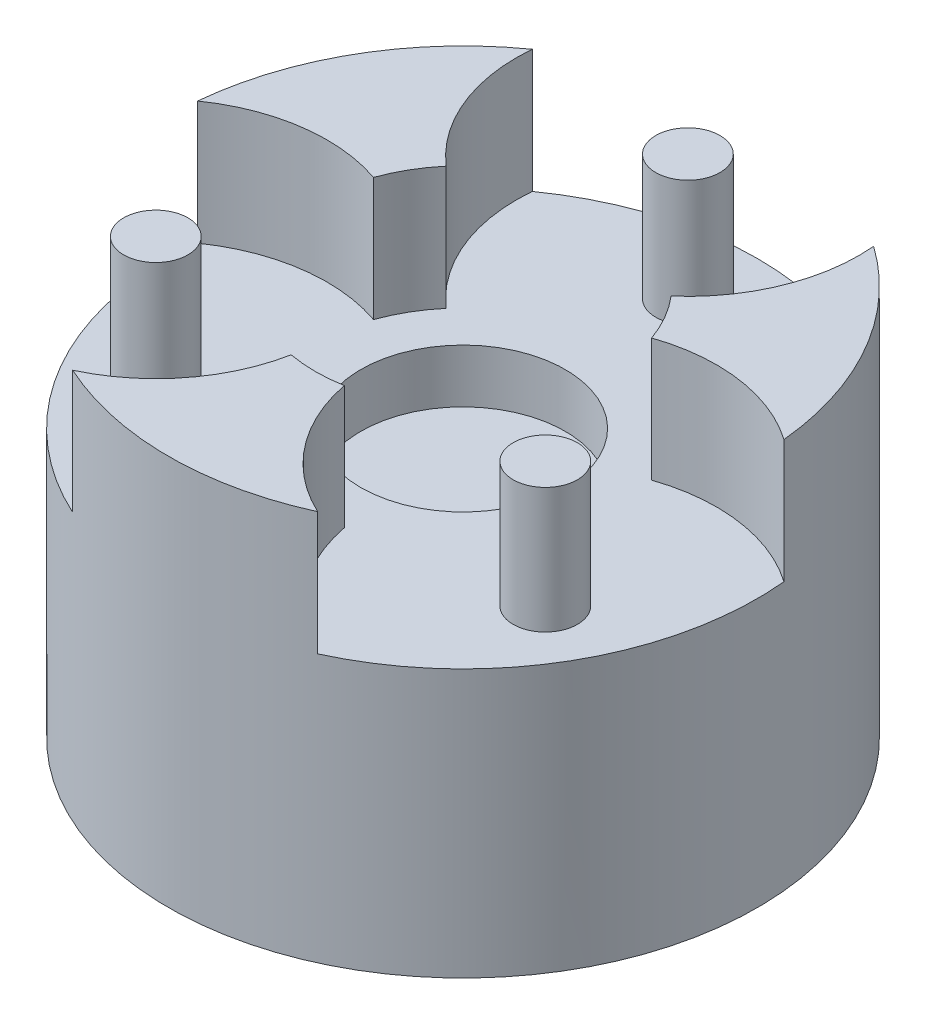
ISO-10303-21;
HEADER;
FILE_DESCRIPTION(('STEP AP214'),'2;1');
FILE_NAME('part.step','',(''),(''),'','','');
FILE_SCHEMA(('AUTOMOTIVE_DESIGN { 1 0 10303 214 1 1 1 1 }'));
ENDSEC;
DATA;
#1=APPLICATION_CONTEXT('core data for automotive mechanical design processes');
#2=APPLICATION_PROTOCOL_DEFINITION('international standard','automotive_design',2000,#1);
#3=PRODUCT_CONTEXT('',#1,'mechanical');
#4=PRODUCT('Part','Part','',(#3));
#5=PRODUCT_RELATED_PRODUCT_CATEGORY('part','',(#4));
#6=PRODUCT_DEFINITION_FORMATION('','',#4);
#7=PRODUCT_DEFINITION_CONTEXT('part definition',#1,'design');
#8=PRODUCT_DEFINITION('design','',#6,#7);
#9=PRODUCT_DEFINITION_SHAPE('','',#8);
#10=(LENGTH_UNIT() NAMED_UNIT(*) SI_UNIT(.MILLI.,.METRE.));
#11=(NAMED_UNIT(*) PLANE_ANGLE_UNIT() SI_UNIT($,.RADIAN.));
#12=(NAMED_UNIT(*) SI_UNIT($,.STERADIAN.) SOLID_ANGLE_UNIT());
#13=UNCERTAINTY_MEASURE_WITH_UNIT(LENGTH_MEASURE(1.E-05),#10,'distance_accuracy_value','');
#14=(GEOMETRIC_REPRESENTATION_CONTEXT(3) GLOBAL_UNCERTAINTY_ASSIGNED_CONTEXT((#13)) GLOBAL_UNIT_ASSIGNED_CONTEXT((#10,
#11,#12)) REPRESENTATION_CONTEXT('',''));
#15=CARTESIAN_POINT('',(0.,0.,0.));
#16=DIRECTION('',(0.,0.,1.));
#17=DIRECTION('',(1.,0.,0.));
#18=AXIS2_PLACEMENT_3D('',#15,#16,#17);
#19=CARTESIAN_POINT('',(0.,5.,0.));
#20=DIRECTION('',(0.,1.,0.));
#21=DIRECTION('',(0.,0.,1.));
#22=AXIS2_PLACEMENT_3D('',#19,#20,#21);
#23=PLANE('',#22);
#24=CARTESIAN_POINT('',(-18.1865334794733,5.,10.4999999999998));
#25=DIRECTION('',(0.,1.,0.));
#26=DIRECTION('',(0.,0.,1.));
#27=AXIS2_PLACEMENT_3D('',#24,#25,#26);
#28=CIRCLE('',#27,3.);
#29=CARTESIAN_POINT('',(-18.1865334794733,5.,13.4999999999998));
#30=VERTEX_POINT('',#29);
#31=EDGE_CURVE('E226',#30,#30,#28,.T.);
#32=ORIENTED_EDGE('',*,*,#31,.F.);
#33=EDGE_LOOP('',(#32));
#34=FACE_BOUND('',#33,.T.);
#35=CARTESIAN_POINT('',(18.1865334794732,5.,10.5000000000001));
#36=DIRECTION('',(0.,1.,0.));
#37=DIRECTION('',(0.,0.,1.));
#38=AXIS2_PLACEMENT_3D('',#35,#36,#37);
#39=CIRCLE('',#38,3.);
#40=CARTESIAN_POINT('',(18.1865334794732,5.,13.5000000000001));
#41=VERTEX_POINT('',#40);
#42=EDGE_CURVE('E232',#41,#41,#39,.T.);
#43=ORIENTED_EDGE('',*,*,#42,.F.);
#44=EDGE_LOOP('',(#43));
#45=FACE_BOUND('',#44,.T.);
#46=CARTESIAN_POINT('',(0.,5.,-21.));
#47=DIRECTION('',(0.,1.,0.));
#48=DIRECTION('',(0.,0.,1.));
#49=AXIS2_PLACEMENT_3D('',#46,#47,#48);
#50=CIRCLE('',#49,3.);
#51=CARTESIAN_POINT('',(0.,5.,-18.));
#52=VERTEX_POINT('',#51);
#53=EDGE_CURVE('E235',#52,#52,#50,.T.);
#54=ORIENTED_EDGE('',*,*,#53,.F.);
#55=EDGE_LOOP('',(#54));
#56=FACE_BOUND('',#55,.T.);
#57=CARTESIAN_POINT('',(0.,5.,0.));
#58=DIRECTION('',(0.,1.,0.));
#59=DIRECTION('',(0.,0.,1.));
#60=AXIS2_PLACEMENT_3D('',#57,#58,#59);
#61=CIRCLE('',#60,9.55);
#62=CARTESIAN_POINT('',(0.,5.,9.55));
#63=VERTEX_POINT('',#62);
#64=EDGE_CURVE('E137',#63,#63,#61,.T.);
#65=ORIENTED_EDGE('',*,*,#64,.F.);
#66=EDGE_LOOP('',(#65));
#67=FACE_BOUND('',#66,.T.);
#68=CARTESIAN_POINT('',(0.,5.,0.));
#69=DIRECTION('',(0.,-1.,0.));
#70=DIRECTION('',(0.,0.,1.));
#71=AXIS2_PLACEMENT_3D('',#68,#69,#70);
#72=CIRCLE('',#71,13.7883262115942);
#73=CARTESIAN_POINT('',(2.48245922660059,5.,13.5630135259684));
#74=VERTEX_POINT('',#73);
#75=CARTESIAN_POINT('',(-2.48245922660077,5.,13.5630135259683));
#76=VERTEX_POINT('',#75);
#77=EDGE_CURVE('E57',#74,#76,#72,.T.);
#78=ORIENTED_EDGE('',*,*,#77,.F.);
#79=CARTESIAN_POINT('',(18.1865334794732,5.,10.5000000000001));
#80=DIRECTION('',(0.,-1.,0.));
#81=DIRECTION('',(0.,0.,1.));
#82=AXIS2_PLACEMENT_3D('',#79,#80,#81);
#83=CIRCLE('',#82,16.);
#84=CARTESIAN_POINT('',(11.4394041014202,5.,25.0077994594569));
#85=VERTEX_POINT('',#84);
#86=EDGE_CURVE('E138',#85,#74,#83,.T.);
#87=ORIENTED_EDGE('',*,*,#86,.F.);
#88=CARTESIAN_POINT('',(0.,5.,0.));
#89=DIRECTION('',(0.,1.,0.));
#90=DIRECTION('',(0.,0.,1.));
#91=AXIS2_PLACEMENT_3D('',#88,#89,#90);
#92=CIRCLE('',#91,27.5);
#93=CARTESIAN_POINT('',(27.3770916753465,5.,-2.59708517374239));
#94=VERTEX_POINT('',#93);
#95=EDGE_CURVE('E50',#85,#94,#92,.T.);
#96=ORIENTED_EDGE('',*,*,#95,.T.);
#97=CARTESIAN_POINT('',(18.1865334794732,5.,10.5000000000001));
#98=DIRECTION('',(0.,-1.,0.));
#99=DIRECTION('',(0.,0.,1.));
#100=AXIS2_PLACEMENT_3D('',#97,#98,#99);
#101=CIRCLE('',#100,16.);
#102=CARTESIAN_POINT('',(12.9871438786609,5.,-4.63163400888887));
#103=VERTEX_POINT('',#102);
#104=EDGE_CURVE('E212',#103,#94,#101,.T.);
#105=ORIENTED_EDGE('',*,*,#104,.F.);
#106=CARTESIAN_POINT('',(0.,5.,0.));
#107=DIRECTION('',(0.,-1.,0.));
#108=DIRECTION('',(0.,0.,1.));
#109=AXIS2_PLACEMENT_3D('',#106,#107,#108);
#110=CIRCLE('',#109,13.7883262115942);
#111=CARTESIAN_POINT('',(10.5046846520602,5.,-8.9313795170794));
#112=VERTEX_POINT('',#111);
#113=EDGE_CURVE('E191',#112,#103,#110,.T.);
#114=ORIENTED_EDGE('',*,*,#113,.F.);
#115=CARTESIAN_POINT('',(0.,5.,-21.));
#116=DIRECTION('',(0.,-1.,0.));
#117=DIRECTION('',(0.,0.,1.));
#118=AXIS2_PLACEMENT_3D('',#115,#116,#117);
#119=CIRCLE('',#118,16.);
#120=CARTESIAN_POINT('',(15.9376875739262,5.,-22.4107142857143));
#121=VERTEX_POINT('',#120);
#122=EDGE_CURVE('E203',#121,#112,#119,.T.);
#123=ORIENTED_EDGE('',*,*,#122,.F.);
#124=CARTESIAN_POINT('',(-15.9376875739262,5.,-22.4107142857143));
#125=VERTEX_POINT('',#124);
#126=EDGE_CURVE('E11',#121,#125,#92,.T.);
#127=ORIENTED_EDGE('',*,*,#126,.T.);
#128=CARTESIAN_POINT('',(0.,5.,-21.));
#129=DIRECTION('',(0.,-1.,0.));
#130=DIRECTION('',(0.,0.,1.));
#131=AXIS2_PLACEMENT_3D('',#128,#129,#130);
#132=CIRCLE('',#131,16.);
#133=CARTESIAN_POINT('',(-10.5046846520602,5.,-8.9313795170794));
#134=VERTEX_POINT('',#133);
#135=EDGE_CURVE('E181',#134,#125,#132,.T.);
#136=ORIENTED_EDGE('',*,*,#135,.F.);
#137=CARTESIAN_POINT('',(0.,5.,0.));
#138=DIRECTION('',(0.,-1.,0.));
#139=DIRECTION('',(0.,0.,1.));
#140=AXIS2_PLACEMENT_3D('',#137,#138,#139);
#141=CIRCLE('',#140,13.7883262115942);
#142=CARTESIAN_POINT('',(-12.9871438786608,5.,-4.63163400888906));
#143=VERTEX_POINT('',#142);
#144=EDGE_CURVE('E184',#143,#134,#141,.T.);
#145=ORIENTED_EDGE('',*,*,#144,.F.);
#146=CARTESIAN_POINT('',(-18.1865334794733,5.,10.4999999999998));
#147=DIRECTION('',(0.,-1.,0.));
#148=DIRECTION('',(0.,0.,1.));
#149=AXIS2_PLACEMENT_3D('',#146,#147,#148);
#150=CIRCLE('',#149,16.);
#151=CARTESIAN_POINT('',(-27.3770916753465,5.,-2.59708517374277));
#152=VERTEX_POINT('',#151);
#153=EDGE_CURVE('E188',#152,#143,#150,.T.);
#154=ORIENTED_EDGE('',*,*,#153,.F.);
#155=CARTESIAN_POINT('',(-11.4394041014205,5.,25.0077994594567));
#156=VERTEX_POINT('',#155);
#157=EDGE_CURVE('E49',#152,#156,#92,.T.);
#158=ORIENTED_EDGE('',*,*,#157,.T.);
#159=CARTESIAN_POINT('',(-18.1865334794733,5.,10.4999999999998));
#160=DIRECTION('',(0.,-1.,0.));
#161=DIRECTION('',(0.,0.,1.));
#162=AXIS2_PLACEMENT_3D('',#159,#160,#161);
#163=CIRCLE('',#162,16.);
#164=EDGE_CURVE('E62',#76,#156,#163,.T.);
#165=ORIENTED_EDGE('',*,*,#164,.F.);
#166=EDGE_LOOP('',(#78,#87,#96,#105,#114,#123,#127,#136,#145,#154,#158,#165));
#167=FACE_BOUND('',#166,.T.);
#168=ADVANCED_FACE('F41',(#34,#45,#56,#67,#167),#23,.T.);
#169=CARTESIAN_POINT('',(0.,5.,0.));
#170=DIRECTION('',(0.,-1.,0.));
#171=DIRECTION('',(0.,0.,-1.));
#172=AXIS2_PLACEMENT_3D('',#169,#170,#171);
#173=CYLINDRICAL_SURFACE('',#172,27.5);
#174=ORIENTED_EDGE('',*,*,#126,.F.);
#175=DIRECTION('',(0.,-1.,0.));
#176=VECTOR('',#175,1.);
#177=CARTESIAN_POINT('',(15.9376875739262,16.5,-22.4107142857143));
#178=LINE('',#177,#176);
#179=CARTESIAN_POINT('',(15.9376875739262,16.5,-22.4107142857143));
#180=VERTEX_POINT('',#179);
#181=EDGE_CURVE('E218',#180,#121,#178,.T.);
#182=ORIENTED_EDGE('',*,*,#181,.F.);
#183=CARTESIAN_POINT('',(0.,16.5,0.));
#184=DIRECTION('',(0.,1.,0.));
#185=DIRECTION('',(0.,0.,1.));
#186=AXIS2_PLACEMENT_3D('',#183,#184,#185);
#187=CIRCLE('',#186,27.5);
#188=CARTESIAN_POINT('',(27.3770916753465,16.5,-2.59708517374239));
#189=VERTEX_POINT('',#188);
#190=EDGE_CURVE('E205',#189,#180,#187,.T.);
#191=ORIENTED_EDGE('',*,*,#190,.F.);
#192=DIRECTION('',(0.,-1.,0.));
#193=VECTOR('',#192,1.);
#194=CARTESIAN_POINT('',(27.3770916753465,16.5,-2.59708517374239));
#195=LINE('',#194,#193);
#196=EDGE_CURVE('E135',#189,#94,#195,.T.);
#197=ORIENTED_EDGE('',*,*,#196,.T.);
#198=ORIENTED_EDGE('',*,*,#95,.F.);
#199=DIRECTION('',(0.,-1.,0.));
#200=VECTOR('',#199,1.);
#201=CARTESIAN_POINT('',(11.4394041014202,16.5,25.0077994594569));
#202=LINE('',#201,#200);
#203=CARTESIAN_POINT('',(11.4394041014202,16.5,25.0077994594569));
#204=VERTEX_POINT('',#203);
#205=EDGE_CURVE('E132',#204,#85,#202,.T.);
#206=ORIENTED_EDGE('',*,*,#205,.F.);
#207=CARTESIAN_POINT('',(0.,16.5,0.));
#208=DIRECTION('',(0.,1.,0.));
#209=DIRECTION('',(0.,0.,1.));
#210=AXIS2_PLACEMENT_3D('',#207,#208,#209);
#211=CIRCLE('',#210,27.5);
#212=CARTESIAN_POINT('',(-11.4394041014205,16.5,25.0077994594567));
#213=VERTEX_POINT('',#212);
#214=EDGE_CURVE('E162',#213,#204,#211,.T.);
#215=ORIENTED_EDGE('',*,*,#214,.F.);
#216=DIRECTION('',(0.,-1.,0.));
#217=VECTOR('',#216,1.);
#218=CARTESIAN_POINT('',(-11.4394041014205,16.5,25.0077994594567));
#219=LINE('',#218,#217);
#220=EDGE_CURVE('E157',#213,#156,#219,.T.);
#221=ORIENTED_EDGE('',*,*,#220,.T.);
#222=ORIENTED_EDGE('',*,*,#157,.F.);
#223=DIRECTION('',(0.,-1.,0.));
#224=VECTOR('',#223,1.);
#225=CARTESIAN_POINT('',(-27.3770916753465,16.5,-2.59708517374277));
#226=LINE('',#225,#224);
#227=CARTESIAN_POINT('',(-27.3770916753465,16.5,-2.59708517374277));
#228=VERTEX_POINT('',#227);
#229=EDGE_CURVE('E142',#228,#152,#226,.T.);
#230=ORIENTED_EDGE('',*,*,#229,.F.);
#231=CARTESIAN_POINT('',(0.,16.5,0.));
#232=DIRECTION('',(0.,1.,0.));
#233=DIRECTION('',(0.,0.,1.));
#234=AXIS2_PLACEMENT_3D('',#231,#232,#233);
#235=CIRCLE('',#234,27.5);
#236=CARTESIAN_POINT('',(-15.9376875739262,16.5,-22.4107142857143));
#237=VERTEX_POINT('',#236);
#238=EDGE_CURVE('E185',#237,#228,#235,.T.);
#239=ORIENTED_EDGE('',*,*,#238,.F.);
#240=DIRECTION('',(0.,-1.,0.));
#241=VECTOR('',#240,1.);
#242=CARTESIAN_POINT('',(-15.9376875739262,16.5,-22.4107142857143));
#243=LINE('',#242,#241);
#244=EDGE_CURVE('E177',#237,#125,#243,.T.);
#245=ORIENTED_EDGE('',*,*,#244,.T.);
#246=EDGE_LOOP('',(#174,#182,#191,#197,#198,#206,#215,#221,#222,#230,#239,#245));
#247=FACE_BOUND('',#246,.T.);
#248=CARTESIAN_POINT('',(0.,-20.,0.));
#249=DIRECTION('',(0.,-1.,0.));
#250=DIRECTION('',(0.,0.,-1.));
#251=AXIS2_PLACEMENT_3D('',#248,#249,#250);
#252=CIRCLE('',#251,27.5);
#253=CARTESIAN_POINT('',(0.,-20.,-27.5));
#254=VERTEX_POINT('',#253);
#255=EDGE_CURVE('E148',#254,#254,#252,.T.);
#256=ORIENTED_EDGE('',*,*,#255,.F.);
#257=EDGE_LOOP('',(#256));
#258=FACE_BOUND('',#257,.T.);
#259=ADVANCED_FACE('F43',(#247,#258),#173,.T.);
#260=CARTESIAN_POINT('',(0.,5.,0.));
#261=DIRECTION('',(0.,-1.,0.));
#262=DIRECTION('',(0.,0.,-1.));
#263=AXIS2_PLACEMENT_3D('',#260,#261,#262);
#264=CYLINDRICAL_SURFACE('',#263,9.55);
#265=ORIENTED_EDGE('',*,*,#64,.T.);
#266=EDGE_LOOP('',(#265));
#267=FACE_BOUND('',#266,.T.);
#268=CARTESIAN_POINT('',(0.,0.,0.));
#269=DIRECTION('',(0.,1.,0.));
#270=DIRECTION('',(0.,0.,1.));
#271=AXIS2_PLACEMENT_3D('',#268,#269,#270);
#272=CIRCLE('',#271,9.55);
#273=CARTESIAN_POINT('',(0.,0.,9.55));
#274=VERTEX_POINT('',#273);
#275=EDGE_CURVE('E241',#274,#274,#272,.T.);
#276=ORIENTED_EDGE('',*,*,#275,.F.);
#277=EDGE_LOOP('',(#276));
#278=FACE_BOUND('',#277,.T.);
#279=ADVANCED_FACE('F250',(#267,#278),#264,.F.);
#280=CARTESIAN_POINT('',(0.,16.7,-21.));
#281=DIRECTION('',(0.,-1.,0.));
#282=DIRECTION('',(0.,0.,-1.));
#283=AXIS2_PLACEMENT_3D('',#280,#281,#282);
#284=CYLINDRICAL_SURFACE('',#283,3.);
#285=CARTESIAN_POINT('',(0.,16.7,-21.));
#286=DIRECTION('',(0.,1.,0.));
#287=DIRECTION('',(0.,0.,1.));
#288=AXIS2_PLACEMENT_3D('',#285,#286,#287);
#289=CIRCLE('',#288,3.);
#290=CARTESIAN_POINT('',(0.,16.7,-18.));
#291=VERTEX_POINT('',#290);
#292=EDGE_CURVE('E238',#291,#291,#289,.T.);
#293=ORIENTED_EDGE('',*,*,#292,.F.);
#294=EDGE_LOOP('',(#293));
#295=FACE_BOUND('',#294,.T.);
#296=ORIENTED_EDGE('',*,*,#53,.T.);
#297=EDGE_LOOP('',(#296));
#298=FACE_BOUND('',#297,.T.);
#299=ADVANCED_FACE('F252',(#295,#298),#284,.T.);
#300=CARTESIAN_POINT('',(0.,16.7,-21.));
#301=DIRECTION('',(0.,1.,0.));
#302=DIRECTION('',(0.,0.,1.));
#303=AXIS2_PLACEMENT_3D('',#300,#301,#302);
#304=PLANE('',#303);
#305=ORIENTED_EDGE('',*,*,#292,.T.);
#306=EDGE_LOOP('',(#305));
#307=FACE_BOUND('',#306,.T.);
#308=ADVANCED_FACE('F258',(#307),#304,.T.);
#309=CARTESIAN_POINT('',(18.1865334794732,16.7,10.5000000000001));
#310=DIRECTION('',(0.,-1.,0.));
#311=DIRECTION('',(0.,0.,-1.));
#312=AXIS2_PLACEMENT_3D('',#309,#310,#311);
#313=CYLINDRICAL_SURFACE('',#312,3.);
#314=CARTESIAN_POINT('',(18.1865334794732,16.7,10.5000000000001));
#315=DIRECTION('',(0.,1.,0.));
#316=DIRECTION('',(0.,0.,1.));
#317=AXIS2_PLACEMENT_3D('',#314,#315,#316);
#318=CIRCLE('',#317,3.);
#319=CARTESIAN_POINT('',(18.1865334794732,16.7,13.5000000000001));
#320=VERTEX_POINT('',#319);
#321=EDGE_CURVE('E229',#320,#320,#318,.T.);
#322=ORIENTED_EDGE('',*,*,#321,.F.);
#323=EDGE_LOOP('',(#322));
#324=FACE_BOUND('',#323,.T.);
#325=ORIENTED_EDGE('',*,*,#42,.T.);
#326=EDGE_LOOP('',(#325));
#327=FACE_BOUND('',#326,.T.);
#328=ADVANCED_FACE('F277',(#324,#327),#313,.T.);
#329=CARTESIAN_POINT('',(18.1865334794732,16.7,10.5000000000001));
#330=DIRECTION('',(0.,1.,0.));
#331=DIRECTION('',(0.,0.,1.));
#332=AXIS2_PLACEMENT_3D('',#329,#330,#331);
#333=PLANE('',#332);
#334=ORIENTED_EDGE('',*,*,#321,.T.);
#335=EDGE_LOOP('',(#334));
#336=FACE_BOUND('',#335,.T.);
#337=ADVANCED_FACE('F279',(#336),#333,.T.);
#338=CARTESIAN_POINT('',(-18.1865334794733,16.7,10.4999999999998));
#339=DIRECTION('',(0.,-1.,0.));
#340=DIRECTION('',(0.,0.,-1.));
#341=AXIS2_PLACEMENT_3D('',#338,#339,#340);
#342=CYLINDRICAL_SURFACE('',#341,3.);
#343=CARTESIAN_POINT('',(-18.1865334794733,16.7,10.4999999999998));
#344=DIRECTION('',(0.,1.,0.));
#345=DIRECTION('',(0.,0.,1.));
#346=AXIS2_PLACEMENT_3D('',#343,#344,#345);
#347=CIRCLE('',#346,3.);
#348=CARTESIAN_POINT('',(-18.1865334794733,16.7,13.4999999999998));
#349=VERTEX_POINT('',#348);
#350=EDGE_CURVE('E225',#349,#349,#347,.T.);
#351=ORIENTED_EDGE('',*,*,#350,.F.);
#352=EDGE_LOOP('',(#351));
#353=FACE_BOUND('',#352,.T.);
#354=ORIENTED_EDGE('',*,*,#31,.T.);
#355=EDGE_LOOP('',(#354));
#356=FACE_BOUND('',#355,.T.);
#357=ADVANCED_FACE('F286',(#353,#356),#342,.T.);
#358=CARTESIAN_POINT('',(-18.1865334794733,16.7,10.4999999999998));
#359=DIRECTION('',(0.,1.,0.));
#360=DIRECTION('',(0.,0.,1.));
#361=AXIS2_PLACEMENT_3D('',#358,#359,#360);
#362=PLANE('',#361);
#363=ORIENTED_EDGE('',*,*,#350,.T.);
#364=EDGE_LOOP('',(#363));
#365=FACE_BOUND('',#364,.T.);
#366=ADVANCED_FACE('F293',(#365),#362,.T.);
#367=CARTESIAN_POINT('',(0.,16.5,0.));
#368=DIRECTION('',(0.,-1.,0.));
#369=DIRECTION('',(0.,0.,-1.));
#370=AXIS2_PLACEMENT_3D('',#367,#368,#369);
#371=CYLINDRICAL_SURFACE('',#370,13.7883262115942);
#372=ORIENTED_EDGE('',*,*,#113,.T.);
#373=DIRECTION('',(0.,-1.,0.));
#374=VECTOR('',#373,1.);
#375=CARTESIAN_POINT('',(12.9871438786609,16.5,-4.63163400888888));
#376=LINE('',#375,#374);
#377=CARTESIAN_POINT('',(12.9871438786609,16.5,-4.63163400888888));
#378=VERTEX_POINT('',#377);
#379=EDGE_CURVE('E222',#378,#103,#376,.T.);
#380=ORIENTED_EDGE('',*,*,#379,.F.);
#381=CARTESIAN_POINT('',(0.,16.5,0.));
#382=DIRECTION('',(0.,-1.,0.));
#383=DIRECTION('',(0.,0.,1.));
#384=AXIS2_PLACEMENT_3D('',#381,#382,#383);
#385=CIRCLE('',#384,13.7883262115942);
#386=CARTESIAN_POINT('',(10.5046846520602,16.5,-8.9313795170794));
#387=VERTEX_POINT('',#386);
#388=EDGE_CURVE('E199',#387,#378,#385,.T.);
#389=ORIENTED_EDGE('',*,*,#388,.F.);
#390=DIRECTION('',(0.,-1.,0.));
#391=VECTOR('',#390,1.);
#392=CARTESIAN_POINT('',(10.5046846520602,16.5,-8.9313795170794));
#393=LINE('',#392,#391);
#394=EDGE_CURVE('E209',#387,#112,#393,.T.);
#395=ORIENTED_EDGE('',*,*,#394,.T.);
#396=EDGE_LOOP('',(#372,#380,#389,#395));
#397=FACE_BOUND('',#396,.T.);
#398=ADVANCED_FACE('F295',(#397),#371,.F.);
#399=CARTESIAN_POINT('',(18.1865334794732,16.5,10.5000000000001));
#400=DIRECTION('',(0.,-1.,0.));
#401=DIRECTION('',(0.,0.,-1.));
#402=AXIS2_PLACEMENT_3D('',#399,#400,#401);
#403=CYLINDRICAL_SURFACE('',#402,16.);
#404=ORIENTED_EDGE('',*,*,#104,.T.);
#405=ORIENTED_EDGE('',*,*,#196,.F.);
#406=CARTESIAN_POINT('',(18.1865334794732,16.5,10.5000000000001));
#407=DIRECTION('',(0.,-1.,0.));
#408=DIRECTION('',(0.,0.,1.));
#409=AXIS2_PLACEMENT_3D('',#406,#407,#408);
#410=CIRCLE('',#409,16.);
#411=EDGE_CURVE('E202',#378,#189,#410,.T.);
#412=ORIENTED_EDGE('',*,*,#411,.F.);
#413=ORIENTED_EDGE('',*,*,#379,.T.);
#414=EDGE_LOOP('',(#404,#405,#412,#413));
#415=FACE_BOUND('',#414,.T.);
#416=ADVANCED_FACE('F301',(#415),#403,.F.);
#417=CARTESIAN_POINT('',(0.,16.5,-21.));
#418=DIRECTION('',(0.,-1.,0.));
#419=DIRECTION('',(0.,0.,-1.));
#420=AXIS2_PLACEMENT_3D('',#417,#418,#419);
#421=CYLINDRICAL_SURFACE('',#420,16.);
#422=ORIENTED_EDGE('',*,*,#122,.T.);
#423=ORIENTED_EDGE('',*,*,#394,.F.);
#424=CARTESIAN_POINT('',(0.,16.5,-21.));
#425=DIRECTION('',(0.,-1.,0.));
#426=DIRECTION('',(0.,0.,1.));
#427=AXIS2_PLACEMENT_3D('',#424,#425,#426);
#428=CIRCLE('',#427,16.);
#429=EDGE_CURVE('E207',#180,#387,#428,.T.);
#430=ORIENTED_EDGE('',*,*,#429,.F.);
#431=ORIENTED_EDGE('',*,*,#181,.T.);
#432=EDGE_LOOP('',(#422,#423,#430,#431));
#433=FACE_BOUND('',#432,.T.);
#434=ADVANCED_FACE('F305',(#433),#421,.F.);
#435=CARTESIAN_POINT('',(0.,16.5,-10.5));
#436=DIRECTION('',(0.,1.,0.));
#437=DIRECTION('',(0.,0.,1.));
#438=AXIS2_PLACEMENT_3D('',#435,#436,#437);
#439=PLANE('',#438);
#440=ORIENTED_EDGE('',*,*,#388,.T.);
#441=ORIENTED_EDGE('',*,*,#411,.T.);
#442=ORIENTED_EDGE('',*,*,#190,.T.);
#443=ORIENTED_EDGE('',*,*,#429,.T.);
#444=EDGE_LOOP('',(#440,#441,#442,#443));
#445=FACE_BOUND('',#444,.T.);
#446=ADVANCED_FACE('F309',(#445),#439,.T.);
#447=CARTESIAN_POINT('',(-18.1865334794733,16.5,10.4999999999998));
#448=DIRECTION('',(0.,-1.,0.));
#449=DIRECTION('',(0.,0.,-1.));
#450=AXIS2_PLACEMENT_3D('',#447,#448,#449);
#451=CYLINDRICAL_SURFACE('',#450,16.);
#452=ORIENTED_EDGE('',*,*,#153,.T.);
#453=DIRECTION('',(0.,-1.,0.));
#454=VECTOR('',#453,1.);
#455=CARTESIAN_POINT('',(-12.9871438786608,16.5,-4.63163400888906));
#456=LINE('',#455,#454);
#457=CARTESIAN_POINT('',(-12.9871438786608,16.5,-4.63163400888906));
#458=VERTEX_POINT('',#457);
#459=EDGE_CURVE('E171',#458,#143,#456,.T.);
#460=ORIENTED_EDGE('',*,*,#459,.F.);
#461=CARTESIAN_POINT('',(-18.1865334794733,16.5,10.4999999999998));
#462=DIRECTION('',(0.,-1.,0.));
#463=DIRECTION('',(0.,0.,1.));
#464=AXIS2_PLACEMENT_3D('',#461,#462,#463);
#465=CIRCLE('',#464,16.);
#466=EDGE_CURVE('E195',#228,#458,#465,.T.);
#467=ORIENTED_EDGE('',*,*,#466,.F.);
#468=ORIENTED_EDGE('',*,*,#229,.T.);
#469=EDGE_LOOP('',(#452,#460,#467,#468));
#470=FACE_BOUND('',#469,.T.);
#471=ADVANCED_FACE('F313',(#470),#451,.F.);
#472=CARTESIAN_POINT('',(0.,16.5,0.));
#473=DIRECTION('',(0.,-1.,0.));
#474=DIRECTION('',(0.,0.,-1.));
#475=AXIS2_PLACEMENT_3D('',#472,#473,#474);
#476=CYLINDRICAL_SURFACE('',#475,13.7883262115942);
#477=ORIENTED_EDGE('',*,*,#144,.T.);
#478=DIRECTION('',(0.,-1.,0.));
#479=VECTOR('',#478,1.);
#480=CARTESIAN_POINT('',(-10.5046846520602,16.5,-8.93137951707941));
#481=LINE('',#480,#479);
#482=CARTESIAN_POINT('',(-10.5046846520602,16.5,-8.93137951707941));
#483=VERTEX_POINT('',#482);
#484=EDGE_CURVE('E174',#483,#134,#481,.T.);
#485=ORIENTED_EDGE('',*,*,#484,.F.);
#486=CARTESIAN_POINT('',(0.,16.5,0.));
#487=DIRECTION('',(0.,-1.,0.));
#488=DIRECTION('',(0.,0.,1.));
#489=AXIS2_PLACEMENT_3D('',#486,#487,#488);
#490=CIRCLE('',#489,13.7883262115942);
#491=EDGE_CURVE('E193',#458,#483,#490,.T.);
#492=ORIENTED_EDGE('',*,*,#491,.F.);
#493=ORIENTED_EDGE('',*,*,#459,.T.);
#494=EDGE_LOOP('',(#477,#485,#492,#493));
#495=FACE_BOUND('',#494,.T.);
#496=ADVANCED_FACE('F322',(#495),#476,.F.);
#497=CARTESIAN_POINT('',(0.,16.5,-21.));
#498=DIRECTION('',(0.,-1.,0.));
#499=DIRECTION('',(0.,0.,-1.));
#500=AXIS2_PLACEMENT_3D('',#497,#498,#499);
#501=CYLINDRICAL_SURFACE('',#500,16.);
#502=ORIENTED_EDGE('',*,*,#135,.T.);
#503=ORIENTED_EDGE('',*,*,#244,.F.);
#504=CARTESIAN_POINT('',(0.,16.5,-21.));
#505=DIRECTION('',(0.,-1.,0.));
#506=DIRECTION('',(0.,0.,1.));
#507=AXIS2_PLACEMENT_3D('',#504,#505,#506);
#508=CIRCLE('',#507,16.);
#509=EDGE_CURVE('E180',#483,#237,#508,.T.);
#510=ORIENTED_EDGE('',*,*,#509,.F.);
#511=ORIENTED_EDGE('',*,*,#484,.T.);
#512=EDGE_LOOP('',(#502,#503,#510,#511));
#513=FACE_BOUND('',#512,.T.);
#514=ADVANCED_FACE('F318',(#513),#501,.F.);
#515=CARTESIAN_POINT('',(-9.09326673973665,16.5,5.24999999999992));
#516=DIRECTION('',(0.,1.,0.));
#517=DIRECTION('',(0.,0.,1.));
#518=AXIS2_PLACEMENT_3D('',#515,#516,#517);
#519=PLANE('',#518);
#520=ORIENTED_EDGE('',*,*,#238,.T.);
#521=ORIENTED_EDGE('',*,*,#466,.T.);
#522=ORIENTED_EDGE('',*,*,#491,.T.);
#523=ORIENTED_EDGE('',*,*,#509,.T.);
#524=EDGE_LOOP('',(#520,#521,#522,#523));
#525=FACE_BOUND('',#524,.T.);
#526=ADVANCED_FACE('F315',(#525),#519,.T.);
#527=CARTESIAN_POINT('',(18.1865334794732,16.5,10.5000000000001));
#528=DIRECTION('',(0.,-1.,0.));
#529=DIRECTION('',(0.,0.,-1.));
#530=AXIS2_PLACEMENT_3D('',#527,#528,#529);
#531=CYLINDRICAL_SURFACE('',#530,16.);
#532=ORIENTED_EDGE('',*,*,#86,.T.);
#533=DIRECTION('',(0.,-1.,0.));
#534=VECTOR('',#533,1.);
#535=CARTESIAN_POINT('',(2.48245922660059,16.5,13.5630135259684));
#536=LINE('',#535,#534);
#537=CARTESIAN_POINT('',(2.48245922660059,16.5,13.5630135259684));
#538=VERTEX_POINT('',#537);
#539=EDGE_CURVE('E147',#538,#74,#536,.T.);
#540=ORIENTED_EDGE('',*,*,#539,.F.);
#541=CARTESIAN_POINT('',(18.1865334794732,16.5,10.5000000000001));
#542=DIRECTION('',(0.,-1.,0.));
#543=DIRECTION('',(0.,0.,1.));
#544=AXIS2_PLACEMENT_3D('',#541,#542,#543);
#545=CIRCLE('',#544,16.);
#546=EDGE_CURVE('E145',#204,#538,#545,.T.);
#547=ORIENTED_EDGE('',*,*,#546,.F.);
#548=ORIENTED_EDGE('',*,*,#205,.T.);
#549=EDGE_LOOP('',(#532,#540,#547,#548));
#550=FACE_BOUND('',#549,.T.);
#551=ADVANCED_FACE('F144',(#550),#531,.F.);
#552=CARTESIAN_POINT('',(0.,16.5,0.));
#553=DIRECTION('',(0.,-1.,0.));
#554=DIRECTION('',(0.,0.,-1.));
#555=AXIS2_PLACEMENT_3D('',#552,#553,#554);
#556=CYLINDRICAL_SURFACE('',#555,13.7883262115942);
#557=ORIENTED_EDGE('',*,*,#77,.T.);
#558=DIRECTION('',(0.,-1.,0.));
#559=VECTOR('',#558,1.);
#560=CARTESIAN_POINT('',(-2.48245922660077,16.5,13.5630135259683));
#561=LINE('',#560,#559);
#562=CARTESIAN_POINT('',(-2.48245922660077,16.5,13.5630135259683));
#563=VERTEX_POINT('',#562);
#564=EDGE_CURVE('E150',#563,#76,#561,.T.);
#565=ORIENTED_EDGE('',*,*,#564,.F.);
#566=CARTESIAN_POINT('',(0.,16.5,0.));
#567=DIRECTION('',(0.,-1.,0.));
#568=DIRECTION('',(0.,0.,1.));
#569=AXIS2_PLACEMENT_3D('',#566,#567,#568);
#570=CIRCLE('',#569,13.7883262115942);
#571=EDGE_CURVE('E165',#538,#563,#570,.T.);
#572=ORIENTED_EDGE('',*,*,#571,.F.);
#573=ORIENTED_EDGE('',*,*,#539,.T.);
#574=EDGE_LOOP('',(#557,#565,#572,#573));
#575=FACE_BOUND('',#574,.T.);
#576=ADVANCED_FACE('F337',(#575),#556,.F.);
#577=CARTESIAN_POINT('',(-18.1865334794733,16.5,10.4999999999998));
#578=DIRECTION('',(0.,-1.,0.));
#579=DIRECTION('',(0.,0.,-1.));
#580=AXIS2_PLACEMENT_3D('',#577,#578,#579);
#581=CYLINDRICAL_SURFACE('',#580,16.);
#582=ORIENTED_EDGE('',*,*,#164,.T.);
#583=ORIENTED_EDGE('',*,*,#220,.F.);
#584=CARTESIAN_POINT('',(-18.1865334794733,16.5,10.4999999999998));
#585=DIRECTION('',(0.,-1.,0.));
#586=DIRECTION('',(0.,0.,1.));
#587=AXIS2_PLACEMENT_3D('',#584,#585,#586);
#588=CIRCLE('',#587,16.);
#589=EDGE_CURVE('E160',#563,#213,#588,.T.);
#590=ORIENTED_EDGE('',*,*,#589,.F.);
#591=ORIENTED_EDGE('',*,*,#564,.T.);
#592=EDGE_LOOP('',(#582,#583,#590,#591));
#593=FACE_BOUND('',#592,.T.);
#594=ADVANCED_FACE('F333',(#593),#581,.F.);
#595=CARTESIAN_POINT('',(9.09326673973658,16.5,5.25000000000004));
#596=DIRECTION('',(0.,1.,0.));
#597=DIRECTION('',(0.,0.,1.));
#598=AXIS2_PLACEMENT_3D('',#595,#596,#597);
#599=PLANE('',#598);
#600=ORIENTED_EDGE('',*,*,#214,.T.);
#601=ORIENTED_EDGE('',*,*,#546,.T.);
#602=ORIENTED_EDGE('',*,*,#571,.T.);
#603=ORIENTED_EDGE('',*,*,#589,.T.);
#604=EDGE_LOOP('',(#600,#601,#602,#603));
#605=FACE_BOUND('',#604,.T.);
#606=ADVANCED_FACE('F330',(#605),#599,.T.);
#607=CARTESIAN_POINT('',(0.,0.,0.));
#608=DIRECTION('',(0.,-1.,0.));
#609=DIRECTION('',(0.,0.,-1.));
#610=AXIS2_PLACEMENT_3D('',#607,#608,#609);
#611=PLANE('',#610);
#612=ORIENTED_EDGE('',*,*,#275,.T.);
#613=EDGE_LOOP('',(#612));
#614=FACE_BOUND('',#613,.T.);
#615=ADVANCED_FACE('F248',(#614),#611,.F.);
#616=CARTESIAN_POINT('',(0.,-20.,0.));
#617=DIRECTION('',(0.,-1.,0.));
#618=DIRECTION('',(0.,0.,-1.));
#619=AXIS2_PLACEMENT_3D('',#616,#617,#618);
#620=PLANE('',#619);
#621=ORIENTED_EDGE('',*,*,#255,.T.);
#622=EDGE_LOOP('',(#621));
#623=FACE_BOUND('',#622,.T.);
#624=ADVANCED_FACE('F346',(#623),#620,.T.);
#625=CLOSED_SHELL('',(#168,#259,#279,#299,#308,#328,#337,#357,#366,#398,#416,#434,#446,#471,
#496,#514,#526,#551,#576,#594,#606,#615,#624));
#626=MANIFOLD_SOLID_BREP('B2',#625);
#627=ADVANCED_BREP_SHAPE_REPRESENTATION('',(#18,#626),#14);
#628=SHAPE_DEFINITION_REPRESENTATION(#9,#627);
ENDSEC;
END-ISO-10303-21;
